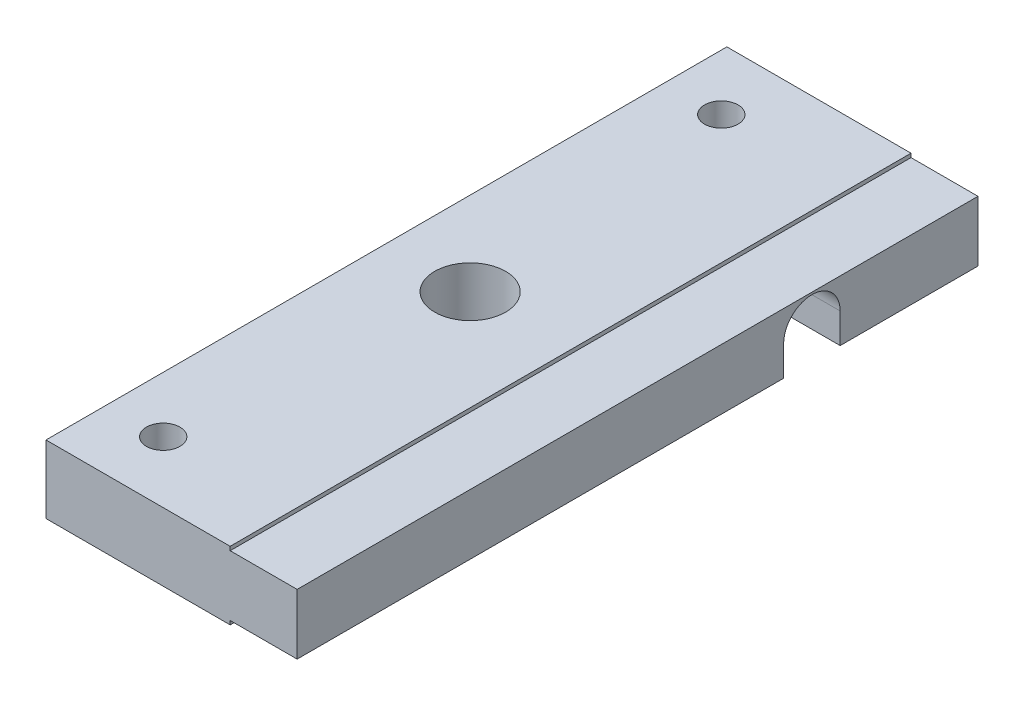
ISO-10303-21;
HEADER;
FILE_DESCRIPTION(('STEP AP214'),'2;1');
FILE_NAME('part.step','',(''),(''),'','','');
FILE_SCHEMA(('AUTOMOTIVE_DESIGN { 1 0 10303 214 1 1 1 1 }'));
ENDSEC;
DATA;
#1=APPLICATION_CONTEXT('core data for automotive mechanical design processes');
#2=APPLICATION_PROTOCOL_DEFINITION('international standard','automotive_design',2000,#1);
#3=PRODUCT_CONTEXT('',#1,'mechanical');
#4=PRODUCT('Part','Part','',(#3));
#5=PRODUCT_RELATED_PRODUCT_CATEGORY('part','',(#4));
#6=PRODUCT_DEFINITION_FORMATION('','',#4);
#7=PRODUCT_DEFINITION_CONTEXT('part definition',#1,'design');
#8=PRODUCT_DEFINITION('design','',#6,#7);
#9=PRODUCT_DEFINITION_SHAPE('','',#8);
#10=(LENGTH_UNIT() NAMED_UNIT(*) SI_UNIT(.MILLI.,.METRE.));
#11=(NAMED_UNIT(*) PLANE_ANGLE_UNIT() SI_UNIT($,.RADIAN.));
#12=(NAMED_UNIT(*) SI_UNIT($,.STERADIAN.) SOLID_ANGLE_UNIT());
#13=UNCERTAINTY_MEASURE_WITH_UNIT(LENGTH_MEASURE(1.E-05),#10,'distance_accuracy_value','');
#14=(GEOMETRIC_REPRESENTATION_CONTEXT(3) GLOBAL_UNCERTAINTY_ASSIGNED_CONTEXT((#13)) GLOBAL_UNIT_ASSIGNED_CONTEXT((#10,
#11,#12)) REPRESENTATION_CONTEXT('',''));
#15=CARTESIAN_POINT('',(0.,0.,0.));
#16=DIRECTION('',(0.,0.,1.));
#17=DIRECTION('',(1.,0.,0.));
#18=AXIS2_PLACEMENT_3D('',#15,#16,#17);
#19=CARTESIAN_POINT('',(22.5,-3.05,0.));
#20=DIRECTION('',(0.,1.,0.));
#21=DIRECTION('',(0.,0.,1.));
#22=AXIS2_PLACEMENT_3D('',#19,#20,#21);
#23=PLANE('',#22);
#24=CARTESIAN_POINT('',(5.00000000000001,-3.05,-5.5));
#25=DIRECTION('',(0.,1.,0.));
#26=DIRECTION('',(0.,0.,1.));
#27=AXIS2_PLACEMENT_3D('',#24,#25,#26);
#28=CIRCLE('',#27,1.5);
#29=CARTESIAN_POINT('',(5.00000000000001,-3.05,-4.));
#30=VERTEX_POINT('',#29);
#31=EDGE_CURVE('E301',#30,#30,#28,.T.);
#32=ORIENTED_EDGE('',*,*,#31,.T.);
#33=EDGE_LOOP('',(#32));
#34=FACE_BOUND('',#33,.T.);
#35=CARTESIAN_POINT('',(7.5,-3.05,-30.5));
#36=DIRECTION('',(0.,1.,0.));
#37=DIRECTION('',(0.,0.,1.));
#38=AXIS2_PLACEMENT_3D('',#35,#36,#37);
#39=CIRCLE('',#38,3.175);
#40=CARTESIAN_POINT('',(7.5,-3.05,-27.325));
#41=VERTEX_POINT('',#40);
#42=EDGE_CURVE('E166',#41,#41,#39,.T.);
#43=ORIENTED_EDGE('',*,*,#42,.T.);
#44=EDGE_LOOP('',(#43));
#45=FACE_BOUND('',#44,.T.);
#46=DIRECTION('',(0.,0.,-1.));
#47=VECTOR('',#46,1.);
#48=CARTESIAN_POINT('',(0.,-3.05,0.));
#49=LINE('',#48,#47);
#50=CARTESIAN_POINT('',(0.,-3.05,0.));
#51=VERTEX_POINT('',#50);
#52=CARTESIAN_POINT('',(0.,-3.05,-43.5866));
#53=VERTEX_POINT('',#52);
#54=EDGE_CURVE('E219',#51,#53,#49,.T.);
#55=ORIENTED_EDGE('',*,*,#54,.T.);
#56=DIRECTION('',(-1.,0.,0.));
#57=VECTOR('',#56,1.);
#58=CARTESIAN_POINT('',(22.5,-3.05,-43.5866));
#59=LINE('',#58,#57);
#60=CARTESIAN_POINT('',(16.5,-3.05,-43.5866));
#61=VERTEX_POINT('',#60);
#62=EDGE_CURVE('E170',#61,#53,#59,.T.);
#63=ORIENTED_EDGE('',*,*,#62,.F.);
#64=DIRECTION('',(0.,0.,-1.));
#65=VECTOR('',#64,1.);
#66=CARTESIAN_POINT('',(16.5,-3.05,0.));
#67=LINE('',#66,#65);
#68=CARTESIAN_POINT('',(16.5,-3.05,0.));
#69=VERTEX_POINT('',#68);
#70=EDGE_CURVE('E204',#69,#61,#67,.T.);
#71=ORIENTED_EDGE('',*,*,#70,.F.);
#72=DIRECTION('',(-1.,0.,0.));
#73=VECTOR('',#72,1.);
#74=CARTESIAN_POINT('',(22.5,-3.05,0.));
#75=LINE('',#74,#73);
#76=EDGE_CURVE('E233',#69,#51,#75,.T.);
#77=ORIENTED_EDGE('',*,*,#76,.T.);
#78=EDGE_LOOP('',(#55,#63,#71,#77));
#79=FACE_BOUND('',#78,.T.);
#80=ADVANCED_FACE('F35',(#34,#45,#79),#23,.F.);
#81=CARTESIAN_POINT('',(16.5,-2.70642000000001,0.));
#82=DIRECTION('',(0.,-1.,0.));
#83=DIRECTION('',(0.,0.,-1.));
#84=AXIS2_PLACEMENT_3D('',#81,#82,#83);
#85=PLANE('',#84);
#86=DIRECTION('',(-1.,0.,0.));
#87=VECTOR('',#86,1.);
#88=CARTESIAN_POINT('',(16.5,-2.70642000000001,-43.5866));
#89=LINE('',#88,#87);
#90=CARTESIAN_POINT('',(22.5,-2.70642000000001,-43.5866));
#91=VERTEX_POINT('',#90);
#92=CARTESIAN_POINT('',(16.5,-2.70642000000001,-43.5866));
#93=VERTEX_POINT('',#92);
#94=EDGE_CURVE('E174',#91,#93,#89,.T.);
#95=ORIENTED_EDGE('',*,*,#94,.F.);
#96=DIRECTION('',(0.,0.,-1.));
#97=VECTOR('',#96,1.);
#98=CARTESIAN_POINT('',(22.5,-2.70642000000001,0.));
#99=LINE('',#98,#97);
#100=CARTESIAN_POINT('',(22.5,-2.70642000000001,0.));
#101=VERTEX_POINT('',#100);
#102=EDGE_CURVE('E184',#101,#91,#99,.T.);
#103=ORIENTED_EDGE('',*,*,#102,.F.);
#104=DIRECTION('',(1.,0.,0.));
#105=VECTOR('',#104,1.);
#106=CARTESIAN_POINT('',(16.5,-2.70642000000001,0.));
#107=LINE('',#106,#105);
#108=CARTESIAN_POINT('',(16.5,-2.70642000000001,0.));
#109=VERTEX_POINT('',#108);
#110=EDGE_CURVE('E183',#109,#101,#107,.T.);
#111=ORIENTED_EDGE('',*,*,#110,.F.);
#112=DIRECTION('',(0.,0.,-1.));
#113=VECTOR('',#112,1.);
#114=CARTESIAN_POINT('',(16.5,-2.70642000000001,0.));
#115=LINE('',#114,#113);
#116=EDGE_CURVE('E176',#109,#93,#115,.T.);
#117=ORIENTED_EDGE('',*,*,#116,.T.);
#118=EDGE_LOOP('',(#95,#103,#111,#117));
#119=FACE_BOUND('',#118,.T.);
#120=ADVANCED_FACE('F260',(#119),#85,.T.);
#121=CARTESIAN_POINT('',(16.5,0.,-30.5));
#122=DIRECTION('',(1.,0.,0.));
#123=DIRECTION('',(0.,0.,-1.));
#124=AXIS2_PLACEMENT_3D('',#121,#122,#123);
#125=PLANE('',#124);
#126=DIRECTION('',(0.,-1.,0.));
#127=VECTOR('',#126,1.);
#128=CARTESIAN_POINT('',(16.5,0.,-43.5866));
#129=LINE('',#128,#127);
#130=EDGE_CURVE('E12',#93,#61,#129,.T.);
#131=ORIENTED_EDGE('',*,*,#130,.F.);
#132=ORIENTED_EDGE('',*,*,#116,.F.);
#133=DIRECTION('',(0.,-1.,0.));
#134=VECTOR('',#133,1.);
#135=CARTESIAN_POINT('',(16.5,-3.05,0.));
#136=LINE('',#135,#134);
#137=EDGE_CURVE('E203',#109,#69,#136,.T.);
#138=ORIENTED_EDGE('',*,*,#137,.T.);
#139=ORIENTED_EDGE('',*,*,#70,.T.);
#140=EDGE_LOOP('',(#131,#132,#138,#139));
#141=FACE_BOUND('',#140,.T.);
#142=ADVANCED_FACE('F263',(#141),#125,.T.);
#143=CARTESIAN_POINT('',(22.5,-3.05,0.));
#144=DIRECTION('',(0.,0.,-1.));
#145=DIRECTION('',(-1.,0.,0.));
#146=AXIS2_PLACEMENT_3D('',#143,#144,#145);
#147=PLANE('',#146);
#148=DIRECTION('',(1.,0.,0.));
#149=VECTOR('',#148,1.);
#150=CARTESIAN_POINT('',(16.5,2.70641999999999,0.));
#151=LINE('',#150,#149);
#152=CARTESIAN_POINT('',(16.5,2.70641999999999,0.));
#153=VERTEX_POINT('',#152);
#154=CARTESIAN_POINT('',(22.5,2.70642,0.));
#155=VERTEX_POINT('',#154);
#156=EDGE_CURVE('E189',#153,#155,#151,.T.);
#157=ORIENTED_EDGE('',*,*,#156,.F.);
#158=CARTESIAN_POINT('',(16.5,3.05,0.));
#159=VERTEX_POINT('',#158);
#160=EDGE_CURVE('E200',#159,#153,#136,.T.);
#161=ORIENTED_EDGE('',*,*,#160,.F.);
#162=DIRECTION('',(-1.,0.,0.));
#163=VECTOR('',#162,1.);
#164=CARTESIAN_POINT('',(22.5,3.05,0.));
#165=LINE('',#164,#163);
#166=CARTESIAN_POINT('',(0.,3.05,0.));
#167=VERTEX_POINT('',#166);
#168=EDGE_CURVE('E214',#159,#167,#165,.T.);
#169=ORIENTED_EDGE('',*,*,#168,.T.);
#170=DIRECTION('',(0.,-1.,0.));
#171=VECTOR('',#170,1.);
#172=CARTESIAN_POINT('',(0.,-3.05,0.));
#173=LINE('',#172,#171);
#174=EDGE_CURVE('E215',#167,#51,#173,.T.);
#175=ORIENTED_EDGE('',*,*,#174,.T.);
#176=ORIENTED_EDGE('',*,*,#76,.F.);
#177=ORIENTED_EDGE('',*,*,#137,.F.);
#178=ORIENTED_EDGE('',*,*,#110,.T.);
#179=DIRECTION('',(0.,-1.,0.));
#180=VECTOR('',#179,1.);
#181=CARTESIAN_POINT('',(22.5,-3.05,0.));
#182=LINE('',#181,#180);
#183=EDGE_CURVE('E208',#155,#101,#182,.T.);
#184=ORIENTED_EDGE('',*,*,#183,.F.);
#185=EDGE_LOOP('',(#157,#161,#169,#175,#176,#177,#178,#184));
#186=FACE_BOUND('',#185,.T.);
#187=ADVANCED_FACE('F37',(#186),#147,.F.);
#188=CARTESIAN_POINT('',(5.,-3.05,-55.5));
#189=DIRECTION('',(0.,1.,0.));
#190=DIRECTION('',(0.,0.,1.));
#191=AXIS2_PLACEMENT_3D('',#188,#189,#190);
#192=CIRCLE('',#191,1.5);
#193=CARTESIAN_POINT('',(5.,-3.05,-54.));
#194=VERTEX_POINT('',#193);
#195=EDGE_CURVE('E306',#194,#194,#192,.T.);
#196=ORIENTED_EDGE('',*,*,#195,.T.);
#197=EDGE_LOOP('',(#196));
#198=FACE_BOUND('',#197,.T.);
#199=CARTESIAN_POINT('',(16.5,-3.05,-48.6514));
#200=VERTEX_POINT('',#199);
#201=CARTESIAN_POINT('',(16.5,-3.05,-61.));
#202=VERTEX_POINT('',#201);
#203=EDGE_CURVE('E207',#200,#202,#67,.T.);
#204=ORIENTED_EDGE('',*,*,#203,.F.);
#205=DIRECTION('',(-1.,0.,0.));
#206=VECTOR('',#205,1.);
#207=CARTESIAN_POINT('',(22.5,-3.05,-48.6514));
#208=LINE('',#207,#206);
#209=CARTESIAN_POINT('',(0.,-3.05,-48.6514));
#210=VERTEX_POINT('',#209);
#211=EDGE_CURVE('E50',#200,#210,#208,.T.);
#212=ORIENTED_EDGE('',*,*,#211,.T.);
#213=CARTESIAN_POINT('',(0.,-3.05,-61.));
#214=VERTEX_POINT('',#213);
#215=EDGE_CURVE('E218',#210,#214,#49,.T.);
#216=ORIENTED_EDGE('',*,*,#215,.T.);
#217=DIRECTION('',(-1.,0.,0.));
#218=VECTOR('',#217,1.);
#219=CARTESIAN_POINT('',(22.5,-3.05,-61.));
#220=LINE('',#219,#218);
#221=EDGE_CURVE('E230',#202,#214,#220,.T.);
#222=ORIENTED_EDGE('',*,*,#221,.F.);
#223=EDGE_LOOP('',(#204,#212,#216,#222));
#224=FACE_BOUND('',#223,.T.);
#225=ADVANCED_FACE('F283',(#198,#224),#23,.F.);
#226=CARTESIAN_POINT('',(22.5,-3.05,-61.));
#227=DIRECTION('',(0.,0.,1.));
#228=DIRECTION('',(1.,0.,0.));
#229=AXIS2_PLACEMENT_3D('',#226,#227,#228);
#230=PLANE('',#229);
#231=DIRECTION('',(1.,0.,0.));
#232=VECTOR('',#231,1.);
#233=CARTESIAN_POINT('',(16.5,2.70642000000001,-61.));
#234=LINE('',#233,#232);
#235=CARTESIAN_POINT('',(16.5,2.70642000000001,-61.));
#236=VERTEX_POINT('',#235);
#237=CARTESIAN_POINT('',(22.5,2.70642000000001,-61.));
#238=VERTEX_POINT('',#237);
#239=EDGE_CURVE('E192',#236,#238,#234,.T.);
#240=ORIENTED_EDGE('',*,*,#239,.T.);
#241=DIRECTION('',(0.,1.,0.));
#242=VECTOR('',#241,1.);
#243=CARTESIAN_POINT('',(22.5,-3.05,-61.));
#244=LINE('',#243,#242);
#245=CARTESIAN_POINT('',(22.5,-2.70642000000001,-61.));
#246=VERTEX_POINT('',#245);
#247=EDGE_CURVE('E211',#246,#238,#244,.T.);
#248=ORIENTED_EDGE('',*,*,#247,.F.);
#249=DIRECTION('',(1.,0.,0.));
#250=VECTOR('',#249,1.);
#251=CARTESIAN_POINT('',(16.5,-2.70642000000001,-61.));
#252=LINE('',#251,#250);
#253=CARTESIAN_POINT('',(16.5,-2.70642000000001,-61.));
#254=VERTEX_POINT('',#253);
#255=EDGE_CURVE('E195',#254,#246,#252,.T.);
#256=ORIENTED_EDGE('',*,*,#255,.F.);
#257=DIRECTION('',(0.,1.,0.));
#258=VECTOR('',#257,1.);
#259=CARTESIAN_POINT('',(16.5,-3.05,-61.));
#260=LINE('',#259,#258);
#261=EDGE_CURVE('E201',#202,#254,#260,.T.);
#262=ORIENTED_EDGE('',*,*,#261,.F.);
#263=ORIENTED_EDGE('',*,*,#221,.T.);
#264=DIRECTION('',(0.,1.,0.));
#265=VECTOR('',#264,1.);
#266=CARTESIAN_POINT('',(0.,-3.05,-61.));
#267=LINE('',#266,#265);
#268=CARTESIAN_POINT('',(0.,3.05,-61.));
#269=VERTEX_POINT('',#268);
#270=EDGE_CURVE('E222',#214,#269,#267,.T.);
#271=ORIENTED_EDGE('',*,*,#270,.T.);
#272=DIRECTION('',(-1.,0.,0.));
#273=VECTOR('',#272,1.);
#274=CARTESIAN_POINT('',(22.5,3.05,-61.));
#275=LINE('',#274,#273);
#276=CARTESIAN_POINT('',(16.5,3.05,-61.));
#277=VERTEX_POINT('',#276);
#278=EDGE_CURVE('E228',#277,#269,#275,.T.);
#279=ORIENTED_EDGE('',*,*,#278,.F.);
#280=EDGE_CURVE('E191',#236,#277,#260,.T.);
#281=ORIENTED_EDGE('',*,*,#280,.F.);
#282=EDGE_LOOP('',(#240,#248,#256,#262,#263,#271,#279,#281));
#283=FACE_BOUND('',#282,.T.);
#284=ADVANCED_FACE('F248',(#283),#230,.F.);
#285=CARTESIAN_POINT('',(22.5,3.05,0.));
#286=DIRECTION('',(0.,-1.,0.));
#287=DIRECTION('',(0.,0.,-1.));
#288=AXIS2_PLACEMENT_3D('',#285,#286,#287);
#289=PLANE('',#288);
#290=CARTESIAN_POINT('',(5.00000000000001,3.05,-5.5));
#291=DIRECTION('',(0.,1.,0.));
#292=DIRECTION('',(0.,0.,1.));
#293=AXIS2_PLACEMENT_3D('',#290,#291,#292);
#294=CIRCLE('',#293,1.5);
#295=CARTESIAN_POINT('',(5.00000000000001,3.05,-4.));
#296=VERTEX_POINT('',#295);
#297=EDGE_CURVE('E312',#296,#296,#294,.T.);
#298=ORIENTED_EDGE('',*,*,#297,.F.);
#299=EDGE_LOOP('',(#298));
#300=FACE_BOUND('',#299,.T.);
#301=CARTESIAN_POINT('',(5.,3.05,-55.5));
#302=DIRECTION('',(0.,1.,0.));
#303=DIRECTION('',(0.,0.,1.));
#304=AXIS2_PLACEMENT_3D('',#301,#302,#303);
#305=CIRCLE('',#304,1.5);
#306=CARTESIAN_POINT('',(5.,3.05,-54.));
#307=VERTEX_POINT('',#306);
#308=EDGE_CURVE('E308',#307,#307,#305,.T.);
#309=ORIENTED_EDGE('',*,*,#308,.F.);
#310=EDGE_LOOP('',(#309));
#311=FACE_BOUND('',#310,.T.);
#312=CARTESIAN_POINT('',(7.5,3.05,-30.5));
#313=DIRECTION('',(0.,1.,0.));
#314=DIRECTION('',(0.,0.,1.));
#315=AXIS2_PLACEMENT_3D('',#312,#313,#314);
#316=CIRCLE('',#315,3.175);
#317=CARTESIAN_POINT('',(7.5,3.05,-27.325));
#318=VERTEX_POINT('',#317);
#319=EDGE_CURVE('E161',#318,#318,#316,.T.);
#320=ORIENTED_EDGE('',*,*,#319,.F.);
#321=EDGE_LOOP('',(#320));
#322=FACE_BOUND('',#321,.T.);
#323=DIRECTION('',(0.,0.,1.));
#324=VECTOR('',#323,1.);
#325=CARTESIAN_POINT('',(16.5,3.05,0.));
#326=LINE('',#325,#324);
#327=EDGE_CURVE('E235',#277,#159,#326,.T.);
#328=ORIENTED_EDGE('',*,*,#327,.F.);
#329=ORIENTED_EDGE('',*,*,#278,.T.);
#330=DIRECTION('',(0.,0.,1.));
#331=VECTOR('',#330,1.);
#332=CARTESIAN_POINT('',(0.,3.05,0.));
#333=LINE('',#332,#331);
#334=EDGE_CURVE('E212',#269,#167,#333,.T.);
#335=ORIENTED_EDGE('',*,*,#334,.T.);
#336=ORIENTED_EDGE('',*,*,#168,.F.);
#337=EDGE_LOOP('',(#328,#329,#335,#336));
#338=FACE_BOUND('',#337,.T.);
#339=ADVANCED_FACE('F278',(#300,#311,#322,#338),#289,.F.);
#340=CARTESIAN_POINT('',(22.5,3.05,0.));
#341=DIRECTION('',(-1.,0.,0.));
#342=DIRECTION('',(0.,0.,1.));
#343=AXIS2_PLACEMENT_3D('',#340,#341,#342);
#344=PLANE('',#343);
#345=ORIENTED_EDGE('',*,*,#102,.T.);
#346=DIRECTION('',(0.,1.,0.));
#347=VECTOR('',#346,1.);
#348=CARTESIAN_POINT('',(22.5,-0.0189799999999915,-43.5866));
#349=LINE('',#348,#347);
#350=CARTESIAN_POINT('',(22.5,-0.0189799999999915,-43.5866));
#351=VERTEX_POINT('',#350);
#352=EDGE_CURVE('E146',#91,#351,#349,.T.);
#353=ORIENTED_EDGE('',*,*,#352,.T.);
#354=CARTESIAN_POINT('',(22.5,-0.0189799999999918,-46.119));
#355=DIRECTION('',(-1.,0.,0.));
#356=DIRECTION('',(0.,0.,1.));
#357=AXIS2_PLACEMENT_3D('',#354,#355,#356);
#358=CIRCLE('',#357,2.5324);
#359=CARTESIAN_POINT('',(22.5,-0.0189799999999918,-48.6514));
#360=VERTEX_POINT('',#359);
#361=EDGE_CURVE('E141',#351,#360,#358,.T.);
#362=ORIENTED_EDGE('',*,*,#361,.T.);
#363=DIRECTION('',(0.,-1.,0.));
#364=VECTOR('',#363,1.);
#365=CARTESIAN_POINT('',(22.5,-3.05,-48.6514));
#366=LINE('',#365,#364);
#367=CARTESIAN_POINT('',(22.5,-2.70642000000001,-48.6514));
#368=VERTEX_POINT('',#367);
#369=EDGE_CURVE('E148',#360,#368,#366,.T.);
#370=ORIENTED_EDGE('',*,*,#369,.T.);
#371=EDGE_CURVE('E58',#368,#246,#99,.T.);
#372=ORIENTED_EDGE('',*,*,#371,.T.);
#373=ORIENTED_EDGE('',*,*,#247,.T.);
#374=DIRECTION('',(0.,0.,1.));
#375=VECTOR('',#374,1.);
#376=CARTESIAN_POINT('',(22.5,2.70641999999999,0.));
#377=LINE('',#376,#375);
#378=EDGE_CURVE('E186',#238,#155,#377,.T.);
#379=ORIENTED_EDGE('',*,*,#378,.T.);
#380=ORIENTED_EDGE('',*,*,#183,.T.);
#381=EDGE_LOOP('',(#345,#353,#362,#370,#372,#373,#379,#380));
#382=FACE_BOUND('',#381,.T.);
#383=ADVANCED_FACE('F154',(#382),#344,.F.);
#384=CARTESIAN_POINT('',(0.,3.05,0.));
#385=DIRECTION('',(-1.,0.,0.));
#386=DIRECTION('',(0.,0.,1.));
#387=AXIS2_PLACEMENT_3D('',#384,#385,#386);
#388=PLANE('',#387);
#389=DIRECTION('',(0.,1.,0.));
#390=VECTOR('',#389,1.);
#391=CARTESIAN_POINT('',(0.,-0.0189799999999915,-43.5866));
#392=LINE('',#391,#390);
#393=CARTESIAN_POINT('',(0.,-0.0189799999999915,-43.5866));
#394=VERTEX_POINT('',#393);
#395=EDGE_CURVE('E155',#53,#394,#392,.T.);
#396=ORIENTED_EDGE('',*,*,#395,.F.);
#397=ORIENTED_EDGE('',*,*,#54,.F.);
#398=ORIENTED_EDGE('',*,*,#174,.F.);
#399=ORIENTED_EDGE('',*,*,#334,.F.);
#400=ORIENTED_EDGE('',*,*,#270,.F.);
#401=ORIENTED_EDGE('',*,*,#215,.F.);
#402=DIRECTION('',(0.,-1.,0.));
#403=VECTOR('',#402,1.);
#404=CARTESIAN_POINT('',(0.,-3.05,-48.6514));
#405=LINE('',#404,#403);
#406=CARTESIAN_POINT('',(0.,-0.0189799999999918,-48.6514));
#407=VERTEX_POINT('',#406);
#408=EDGE_CURVE('E158',#407,#210,#405,.T.);
#409=ORIENTED_EDGE('',*,*,#408,.F.);
#410=CARTESIAN_POINT('',(0.,-0.0189799999999918,-46.119));
#411=DIRECTION('',(-1.,0.,0.));
#412=DIRECTION('',(0.,0.,1.));
#413=AXIS2_PLACEMENT_3D('',#410,#411,#412);
#414=CIRCLE('',#413,2.5324);
#415=EDGE_CURVE('E144',#394,#407,#414,.T.);
#416=ORIENTED_EDGE('',*,*,#415,.F.);
#417=EDGE_LOOP('',(#396,#397,#398,#399,#400,#401,#409,#416));
#418=FACE_BOUND('',#417,.T.);
#419=ADVANCED_FACE('F273',(#418),#388,.T.);
#420=DIRECTION('',(1.,0.,0.));
#421=VECTOR('',#420,1.);
#422=CARTESIAN_POINT('',(16.5,-2.70642000000001,-48.6514));
#423=LINE('',#422,#421);
#424=CARTESIAN_POINT('',(16.5,-2.70642000000001,-48.6514));
#425=VERTEX_POINT('',#424);
#426=EDGE_CURVE('E151',#425,#368,#423,.T.);
#427=ORIENTED_EDGE('',*,*,#426,.F.);
#428=EDGE_CURVE('E180',#425,#254,#115,.T.);
#429=ORIENTED_EDGE('',*,*,#428,.T.);
#430=ORIENTED_EDGE('',*,*,#255,.T.);
#431=ORIENTED_EDGE('',*,*,#371,.F.);
#432=EDGE_LOOP('',(#427,#429,#430,#431));
#433=FACE_BOUND('',#432,.T.);
#434=ADVANCED_FACE('F240',(#433),#85,.T.);
#435=DIRECTION('',(0.,1.,0.));
#436=VECTOR('',#435,1.);
#437=CARTESIAN_POINT('',(16.5,0.,-48.6514));
#438=LINE('',#437,#436);
#439=EDGE_CURVE('E43',#200,#425,#438,.T.);
#440=ORIENTED_EDGE('',*,*,#439,.F.);
#441=ORIENTED_EDGE('',*,*,#203,.T.);
#442=ORIENTED_EDGE('',*,*,#261,.T.);
#443=ORIENTED_EDGE('',*,*,#428,.F.);
#444=EDGE_LOOP('',(#440,#441,#442,#443));
#445=FACE_BOUND('',#444,.T.);
#446=ADVANCED_FACE('F242',(#445),#125,.T.);
#447=ORIENTED_EDGE('',*,*,#160,.T.);
#448=DIRECTION('',(0.,0.,1.));
#449=VECTOR('',#448,1.);
#450=CARTESIAN_POINT('',(16.5,2.70641999999999,0.));
#451=LINE('',#450,#449);
#452=EDGE_CURVE('E179',#236,#153,#451,.T.);
#453=ORIENTED_EDGE('',*,*,#452,.F.);
#454=ORIENTED_EDGE('',*,*,#280,.T.);
#455=ORIENTED_EDGE('',*,*,#327,.T.);
#456=EDGE_LOOP('',(#447,#453,#454,#455));
#457=FACE_BOUND('',#456,.T.);
#458=ADVANCED_FACE('F345',(#457),#125,.T.);
#459=CARTESIAN_POINT('',(16.5,2.70641999999999,0.));
#460=DIRECTION('',(0.,1.,0.));
#461=DIRECTION('',(0.,0.,1.));
#462=AXIS2_PLACEMENT_3D('',#459,#460,#461);
#463=PLANE('',#462);
#464=ORIENTED_EDGE('',*,*,#378,.F.);
#465=ORIENTED_EDGE('',*,*,#239,.F.);
#466=ORIENTED_EDGE('',*,*,#452,.T.);
#467=ORIENTED_EDGE('',*,*,#156,.T.);
#468=EDGE_LOOP('',(#464,#465,#466,#467));
#469=FACE_BOUND('',#468,.T.);
#470=ADVANCED_FACE('F343',(#469),#463,.T.);
#471=CARTESIAN_POINT('',(22.5,-0.0189799999999918,-46.119));
#472=DIRECTION('',(-1.,0.,0.));
#473=DIRECTION('',(0.,0.,1.));
#474=AXIS2_PLACEMENT_3D('',#471,#472,#473);
#475=CYLINDRICAL_SURFACE('',#474,2.5324);
#476=ORIENTED_EDGE('',*,*,#415,.T.);
#477=DIRECTION('',(-1.,0.,0.));
#478=VECTOR('',#477,1.);
#479=CARTESIAN_POINT('',(22.5,-0.0189799999999918,-48.6514));
#480=LINE('',#479,#478);
#481=EDGE_CURVE('E137',#360,#407,#480,.T.);
#482=ORIENTED_EDGE('',*,*,#481,.F.);
#483=ORIENTED_EDGE('',*,*,#361,.F.);
#484=DIRECTION('',(-1.,0.,0.));
#485=VECTOR('',#484,1.);
#486=CARTESIAN_POINT('',(22.5,-0.0189799999999915,-43.5866));
#487=LINE('',#486,#485);
#488=EDGE_CURVE('E168',#351,#394,#487,.T.);
#489=ORIENTED_EDGE('',*,*,#488,.T.);
#490=EDGE_LOOP('',(#476,#482,#483,#489));
#491=FACE_BOUND('',#490,.T.);
#492=ADVANCED_FACE('F139',(#491),#475,.F.);
#493=CARTESIAN_POINT('',(22.5,-0.0189799999999915,-43.5866));
#494=DIRECTION('',(0.,0.,1.));
#495=DIRECTION('',(1.,0.,0.));
#496=AXIS2_PLACEMENT_3D('',#493,#494,#495);
#497=PLANE('',#496);
#498=ORIENTED_EDGE('',*,*,#94,.T.);
#499=ORIENTED_EDGE('',*,*,#130,.T.);
#500=ORIENTED_EDGE('',*,*,#62,.T.);
#501=ORIENTED_EDGE('',*,*,#395,.T.);
#502=ORIENTED_EDGE('',*,*,#488,.F.);
#503=ORIENTED_EDGE('',*,*,#352,.F.);
#504=EDGE_LOOP('',(#498,#499,#500,#501,#502,#503));
#505=FACE_BOUND('',#504,.T.);
#506=ADVANCED_FACE('F267',(#505),#497,.F.);
#507=CARTESIAN_POINT('',(22.5,-3.05,-48.6514));
#508=DIRECTION('',(0.,0.,-1.));
#509=DIRECTION('',(0.,1.,0.));
#510=AXIS2_PLACEMENT_3D('',#507,#508,#509);
#511=PLANE('',#510);
#512=ORIENTED_EDGE('',*,*,#426,.T.);
#513=ORIENTED_EDGE('',*,*,#369,.F.);
#514=ORIENTED_EDGE('',*,*,#481,.T.);
#515=ORIENTED_EDGE('',*,*,#408,.T.);
#516=ORIENTED_EDGE('',*,*,#211,.F.);
#517=ORIENTED_EDGE('',*,*,#439,.T.);
#518=EDGE_LOOP('',(#512,#513,#514,#515,#516,#517));
#519=FACE_BOUND('',#518,.T.);
#520=ADVANCED_FACE('F149',(#519),#511,.F.);
#521=CARTESIAN_POINT('',(7.5,-3.05,-30.5));
#522=DIRECTION('',(0.,1.,0.));
#523=DIRECTION('',(0.,0.,1.));
#524=AXIS2_PLACEMENT_3D('',#521,#522,#523);
#525=CYLINDRICAL_SURFACE('',#524,3.175);
#526=ORIENTED_EDGE('',*,*,#42,.F.);
#527=EDGE_LOOP('',(#526));
#528=FACE_BOUND('',#527,.T.);
#529=ORIENTED_EDGE('',*,*,#319,.T.);
#530=EDGE_LOOP('',(#529));
#531=FACE_BOUND('',#530,.T.);
#532=ADVANCED_FACE('F326',(#528,#531),#525,.F.);
#533=CARTESIAN_POINT('',(5.,-3.05,-55.5));
#534=DIRECTION('',(0.,1.,0.));
#535=DIRECTION('',(0.,0.,1.));
#536=AXIS2_PLACEMENT_3D('',#533,#534,#535);
#537=CYLINDRICAL_SURFACE('',#536,1.5);
#538=ORIENTED_EDGE('',*,*,#195,.F.);
#539=EDGE_LOOP('',(#538));
#540=FACE_BOUND('',#539,.T.);
#541=ORIENTED_EDGE('',*,*,#308,.T.);
#542=EDGE_LOOP('',(#541));
#543=FACE_BOUND('',#542,.T.);
#544=ADVANCED_FACE('F328',(#540,#543),#537,.F.);
#545=CARTESIAN_POINT('',(5.00000000000001,-3.05,-5.5));
#546=DIRECTION('',(0.,1.,0.));
#547=DIRECTION('',(0.,0.,1.));
#548=AXIS2_PLACEMENT_3D('',#545,#546,#547);
#549=CYLINDRICAL_SURFACE('',#548,1.5);
#550=ORIENTED_EDGE('',*,*,#31,.F.);
#551=EDGE_LOOP('',(#550));
#552=FACE_BOUND('',#551,.T.);
#553=ORIENTED_EDGE('',*,*,#297,.T.);
#554=EDGE_LOOP('',(#553));
#555=FACE_BOUND('',#554,.T.);
#556=ADVANCED_FACE('F317',(#552,#555),#549,.F.);
#557=CLOSED_SHELL('',(#80,#120,#142,#187,#225,#284,#339,#383,#419,#434,#446,#458,#470,#492,#506,
#520,#532,#544,#556));
#558=MANIFOLD_SOLID_BREP('B2',#557);
#559=ADVANCED_BREP_SHAPE_REPRESENTATION('',(#18,#558),#14);
#560=SHAPE_DEFINITION_REPRESENTATION(#9,#559);
ENDSEC;
END-ISO-10303-21;
